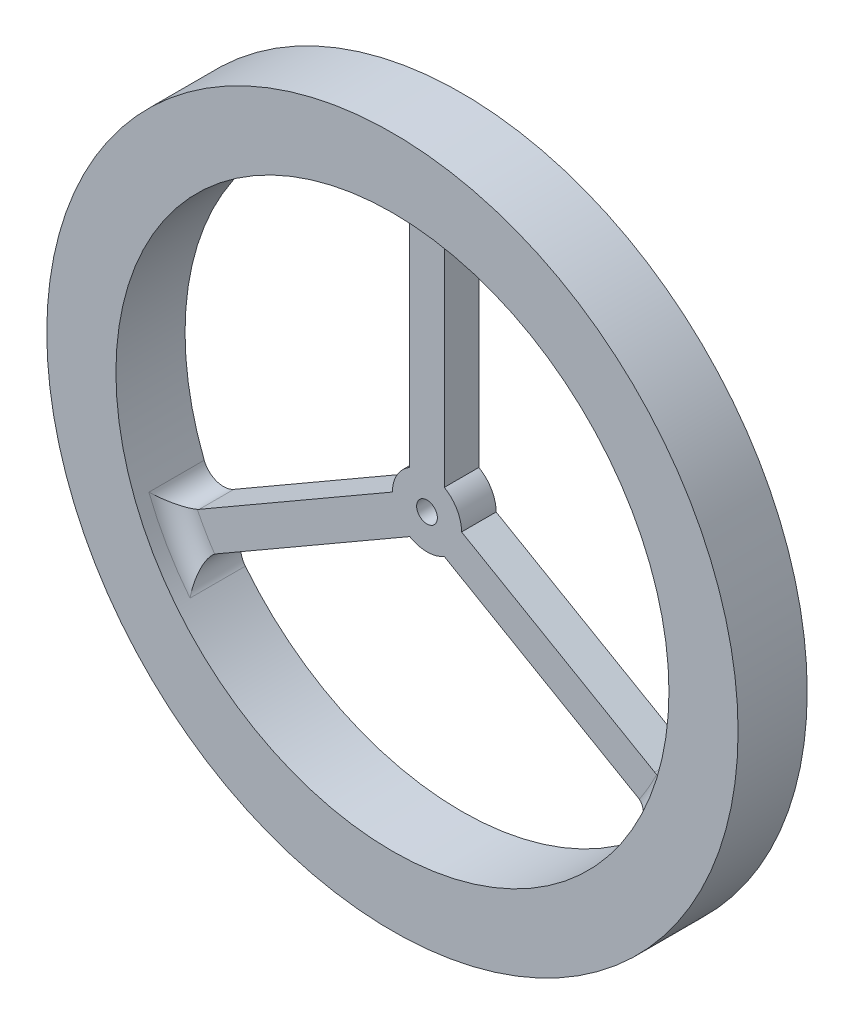
ISO-10303-21;
HEADER;
FILE_DESCRIPTION(('STEP AP214'),'2;1');
FILE_NAME('part.step','',(''),(''),'','','');
FILE_SCHEMA(('AUTOMOTIVE_DESIGN { 1 0 10303 214 1 1 1 1 }'));
ENDSEC;
DATA;
#1=APPLICATION_CONTEXT('core data for automotive mechanical design processes');
#2=APPLICATION_PROTOCOL_DEFINITION('international standard','automotive_design',2000,#1);
#3=PRODUCT_CONTEXT('',#1,'mechanical');
#4=PRODUCT('Part','Part','',(#3));
#5=PRODUCT_RELATED_PRODUCT_CATEGORY('part','',(#4));
#6=PRODUCT_DEFINITION_FORMATION('','',#4);
#7=PRODUCT_DEFINITION_CONTEXT('part definition',#1,'design');
#8=PRODUCT_DEFINITION('design','',#6,#7);
#9=PRODUCT_DEFINITION_SHAPE('','',#8);
#10=(LENGTH_UNIT() NAMED_UNIT(*) SI_UNIT(.MILLI.,.METRE.));
#11=(NAMED_UNIT(*) PLANE_ANGLE_UNIT() SI_UNIT($,.RADIAN.));
#12=(NAMED_UNIT(*) SI_UNIT($,.STERADIAN.) SOLID_ANGLE_UNIT());
#13=UNCERTAINTY_MEASURE_WITH_UNIT(LENGTH_MEASURE(1.E-05),#10,'distance_accuracy_value','');
#14=(GEOMETRIC_REPRESENTATION_CONTEXT(3) GLOBAL_UNCERTAINTY_ASSIGNED_CONTEXT((#13)) GLOBAL_UNIT_ASSIGNED_CONTEXT((#10,
#11,#12)) REPRESENTATION_CONTEXT('',''));
#15=CARTESIAN_POINT('',(0.,0.,0.));
#16=DIRECTION('',(0.,0.,1.));
#17=DIRECTION('',(1.,0.,0.));
#18=AXIS2_PLACEMENT_3D('',#15,#16,#17);
#19=CARTESIAN_POINT('',(2.5,40.,5.));
#20=DIRECTION('',(-1.,0.,0.));
#21=DIRECTION('',(0.,-1.,0.));
#22=AXIS2_PLACEMENT_3D('',#19,#20,#21);
#23=PLANE('',#22);
#24=DIRECTION('',(0.,0.,-1.));
#25=VECTOR('',#24,1.);
#26=CARTESIAN_POINT('',(2.5,4.33012701892219,5.));
#27=LINE('',#26,#25);
#28=CARTESIAN_POINT('',(2.5,4.33012701892219,0.));
#29=VERTEX_POINT('',#28);
#30=CARTESIAN_POINT('',(2.5,4.33012701892219,5.));
#31=VERTEX_POINT('',#30);
#32=EDGE_CURVE('E64',#29,#31,#27,.F.);
#33=ORIENTED_EDGE('',*,*,#32,.F.);
#34=DIRECTION('',(0.,1.,0.));
#35=VECTOR('',#34,1.);
#36=CARTESIAN_POINT('',(2.5,40.,0.));
#37=LINE('',#36,#35);
#38=CARTESIAN_POINT('',(2.5,36.5889327529514,0.));
#39=VERTEX_POINT('',#38);
#40=EDGE_CURVE('E268',#29,#39,#37,.T.);
#41=ORIENTED_EDGE('',*,*,#40,.T.);
#42=DIRECTION('',(0.,0.,-1.));
#43=VECTOR('',#42,1.);
#44=CARTESIAN_POINT('',(2.5,36.5889327529514,5.));
#45=LINE('',#44,#43);
#46=CARTESIAN_POINT('',(2.5,36.5889327529514,5.));
#47=VERTEX_POINT('',#46);
#48=EDGE_CURVE('E306',#39,#47,#45,.F.);
#49=ORIENTED_EDGE('',*,*,#48,.T.);
#50=DIRECTION('',(0.,1.,0.));
#51=VECTOR('',#50,1.);
#52=CARTESIAN_POINT('',(2.5,40.,5.));
#53=LINE('',#52,#51);
#54=EDGE_CURVE('E260',#31,#47,#53,.T.);
#55=ORIENTED_EDGE('',*,*,#54,.F.);
#56=EDGE_LOOP('',(#33,#41,#49,#55));
#57=FACE_BOUND('',#56,.T.);
#58=ADVANCED_FACE('F39',(#57),#23,.F.);
#59=CARTESIAN_POINT('',(-2.5,40.,5.));
#60=DIRECTION('',(1.,0.,0.));
#61=DIRECTION('',(0.,1.,0.));
#62=AXIS2_PLACEMENT_3D('',#59,#60,#61);
#63=PLANE('',#62);
#64=DIRECTION('',(0.,0.,-1.));
#65=VECTOR('',#64,1.);
#66=CARTESIAN_POINT('',(-2.5,4.33012701892219,5.));
#67=LINE('',#66,#65);
#68=CARTESIAN_POINT('',(-2.5,4.33012701892219,5.));
#69=VERTEX_POINT('',#68);
#70=CARTESIAN_POINT('',(-2.5,4.33012701892219,0.));
#71=VERTEX_POINT('',#70);
#72=EDGE_CURVE('E212',#69,#71,#67,.T.);
#73=ORIENTED_EDGE('',*,*,#72,.F.);
#74=DIRECTION('',(0.,-1.,0.));
#75=VECTOR('',#74,1.);
#76=CARTESIAN_POINT('',(-2.5,40.,5.));
#77=LINE('',#76,#75);
#78=CARTESIAN_POINT('',(-2.5,36.5889327529514,5.));
#79=VERTEX_POINT('',#78);
#80=EDGE_CURVE('E263',#79,#69,#77,.T.);
#81=ORIENTED_EDGE('',*,*,#80,.F.);
#82=DIRECTION('',(0.,0.,-1.));
#83=VECTOR('',#82,1.);
#84=CARTESIAN_POINT('',(-2.5,36.5889327529514,5.));
#85=LINE('',#84,#83);
#86=CARTESIAN_POINT('',(-2.5,36.5889327529514,0.));
#87=VERTEX_POINT('',#86);
#88=EDGE_CURVE('E303',#79,#87,#85,.T.);
#89=ORIENTED_EDGE('',*,*,#88,.T.);
#90=DIRECTION('',(0.,-1.,0.));
#91=VECTOR('',#90,1.);
#92=CARTESIAN_POINT('',(-2.5,40.,0.));
#93=LINE('',#92,#91);
#94=EDGE_CURVE('E56',#87,#71,#93,.T.);
#95=ORIENTED_EDGE('',*,*,#94,.T.);
#96=EDGE_LOOP('',(#73,#81,#89,#95));
#97=FACE_BOUND('',#96,.T.);
#98=ADVANCED_FACE('F531',(#97),#63,.F.);
#99=CARTESIAN_POINT('',(35.8910161513775,-17.8349364905391,5.));
#100=DIRECTION('',(-0.500000000000004,-0.866025403784436,0.));
#101=DIRECTION('',(0.866025403784436,-0.500000000000004,0.));
#102=AXIS2_PLACEMENT_3D('',#99,#100,#101);
#103=PLANE('',#102);
#104=DIRECTION('',(0.,0.,-1.));
#105=VECTOR('',#104,1.);
#106=CARTESIAN_POINT('',(5.,0.,5.));
#107=LINE('',#106,#105);
#108=CARTESIAN_POINT('',(4.99999999999999,0.,5.));
#109=VERTEX_POINT('',#108);
#110=CARTESIAN_POINT('',(4.99999999999999,0.,0.));
#111=VERTEX_POINT('',#110);
#112=EDGE_CURVE('E208',#109,#111,#107,.T.);
#113=ORIENTED_EDGE('',*,*,#112,.F.);
#114=DIRECTION('',(-0.866025403784437,0.500000000000004,0.));
#115=VECTOR('',#114,1.);
#116=CARTESIAN_POINT('',(35.8910161513775,-17.8349364905391,5.));
#117=LINE('',#116,#115);
#118=CARTESIAN_POINT('',(32.9369452614163,-16.1294028670148,5.));
#119=VERTEX_POINT('',#118);
#120=EDGE_CURVE('E250',#119,#109,#117,.T.);
#121=ORIENTED_EDGE('',*,*,#120,.F.);
#122=DIRECTION('',(0.,0.,-1.));
#123=VECTOR('',#122,1.);
#124=CARTESIAN_POINT('',(32.9369452614163,-16.1294028670148,5.));
#125=LINE('',#124,#123);
#126=CARTESIAN_POINT('',(32.9369452614163,-16.1294028670148,0.));
#127=VERTEX_POINT('',#126);
#128=EDGE_CURVE('E478',#119,#127,#125,.T.);
#129=ORIENTED_EDGE('',*,*,#128,.T.);
#130=DIRECTION('',(-0.866025403784437,0.500000000000004,0.));
#131=VECTOR('',#130,1.);
#132=CARTESIAN_POINT('',(35.8910161513775,-17.8349364905391,0.));
#133=LINE('',#132,#131);
#134=EDGE_CURVE('E251',#127,#111,#133,.T.);
#135=ORIENTED_EDGE('',*,*,#134,.T.);
#136=EDGE_LOOP('',(#113,#121,#129,#135));
#137=FACE_BOUND('',#136,.T.);
#138=ADVANCED_FACE('F536',(#137),#103,.F.);
#139=CARTESIAN_POINT('',(-35.8910161513777,-17.8349364905386,5.));
#140=DIRECTION('',(0.499999999999992,-0.866025403784443,0.));
#141=DIRECTION('',(0.866025403784443,0.499999999999992,0.));
#142=AXIS2_PLACEMENT_3D('',#139,#140,#141);
#143=PLANE('',#142);
#144=DIRECTION('',(0.,0.,-1.));
#145=VECTOR('',#144,1.);
#146=CARTESIAN_POINT('',(-5.,0.,5.));
#147=LINE('',#146,#145);
#148=CARTESIAN_POINT('',(-5.,0.,0.));
#149=VERTEX_POINT('',#148);
#150=CARTESIAN_POINT('',(-5.00000000000001,0.,5.));
#151=VERTEX_POINT('',#150);
#152=EDGE_CURVE('E201',#149,#151,#147,.F.);
#153=ORIENTED_EDGE('',*,*,#152,.F.);
#154=DIRECTION('',(-0.866025403784443,-0.499999999999992,0.));
#155=VECTOR('',#154,1.);
#156=CARTESIAN_POINT('',(-35.8910161513777,-17.8349364905386,0.));
#157=LINE('',#156,#155);
#158=CARTESIAN_POINT('',(-32.9369452614166,-16.1294028670143,0.));
#159=VERTEX_POINT('',#158);
#160=EDGE_CURVE('E184',#149,#159,#157,.T.);
#161=ORIENTED_EDGE('',*,*,#160,.T.);
#162=DIRECTION('',(0.,0.,-1.));
#163=VECTOR('',#162,1.);
#164=CARTESIAN_POINT('',(-32.9369452614166,-16.1294028670143,5.));
#165=LINE('',#164,#163);
#166=CARTESIAN_POINT('',(-32.9369452614166,-16.1294028670143,5.));
#167=VERTEX_POINT('',#166);
#168=EDGE_CURVE('E433',#159,#167,#165,.F.);
#169=ORIENTED_EDGE('',*,*,#168,.T.);
#170=DIRECTION('',(-0.866025403784443,-0.499999999999992,0.));
#171=VECTOR('',#170,1.);
#172=CARTESIAN_POINT('',(-35.8910161513777,-17.8349364905386,5.));
#173=LINE('',#172,#171);
#174=EDGE_CURVE('E203',#151,#167,#173,.T.);
#175=ORIENTED_EDGE('',*,*,#174,.F.);
#176=EDGE_LOOP('',(#153,#161,#169,#175));
#177=FACE_BOUND('',#176,.T.);
#178=ADVANCED_FACE('F202',(#177),#143,.F.);
#179=CARTESIAN_POINT('',(33.3910161513775,-22.1650635094613,5.));
#180=DIRECTION('',(0.500000000000004,0.866025403784436,0.));
#181=DIRECTION('',(-0.866025403784436,0.500000000000004,0.));
#182=AXIS2_PLACEMENT_3D('',#179,#180,#181);
#183=PLANE('',#182);
#184=DIRECTION('',(0.,0.,-1.));
#185=VECTOR('',#184,1.);
#186=CARTESIAN_POINT('',(2.49999999999998,-4.33012701892221,5.));
#187=LINE('',#186,#185);
#188=CARTESIAN_POINT('',(2.49999999999996,-4.3301270189222,0.));
#189=VERTEX_POINT('',#188);
#190=CARTESIAN_POINT('',(2.49999999999996,-4.3301270189222,5.));
#191=VERTEX_POINT('',#190);
#192=EDGE_CURVE('E209',#189,#191,#187,.F.);
#193=ORIENTED_EDGE('',*,*,#192,.F.);
#194=DIRECTION('',(0.866025403784437,-0.500000000000004,0.));
#195=VECTOR('',#194,1.);
#196=CARTESIAN_POINT('',(33.3910161513775,-22.1650635094613,0.));
#197=LINE('',#196,#195);
#198=CARTESIAN_POINT('',(30.4369452614163,-20.4595298859369,0.));
#199=VERTEX_POINT('',#198);
#200=EDGE_CURVE('E243',#189,#199,#197,.T.);
#201=ORIENTED_EDGE('',*,*,#200,.T.);
#202=DIRECTION('',(0.,0.,-1.));
#203=VECTOR('',#202,1.);
#204=CARTESIAN_POINT('',(30.4369452614163,-20.4595298859369,5.));
#205=LINE('',#204,#203);
#206=CARTESIAN_POINT('',(30.4369452614163,-20.4595298859369,5.));
#207=VERTEX_POINT('',#206);
#208=EDGE_CURVE('E474',#199,#207,#205,.F.);
#209=ORIENTED_EDGE('',*,*,#208,.T.);
#210=DIRECTION('',(0.866025403784437,-0.500000000000004,0.));
#211=VECTOR('',#210,1.);
#212=CARTESIAN_POINT('',(33.3910161513775,-22.1650635094613,5.));
#213=LINE('',#212,#211);
#214=EDGE_CURVE('E247',#191,#207,#213,.T.);
#215=ORIENTED_EDGE('',*,*,#214,.F.);
#216=EDGE_LOOP('',(#193,#201,#209,#215));
#217=FACE_BOUND('',#216,.T.);
#218=ADVANCED_FACE('F461',(#217),#183,.F.);
#219=CARTESIAN_POINT('',(-33.3910161513778,-22.1650635094608,5.));
#220=DIRECTION('',(-0.499999999999992,0.866025403784443,0.));
#221=DIRECTION('',(-0.866025403784443,-0.499999999999992,0.));
#222=AXIS2_PLACEMENT_3D('',#219,#220,#221);
#223=PLANE('',#222);
#224=DIRECTION('',(0.,0.,-1.));
#225=VECTOR('',#224,1.);
#226=CARTESIAN_POINT('',(-2.50000000000004,-4.33012701892217,5.));
#227=LINE('',#226,#225);
#228=CARTESIAN_POINT('',(-2.50000000000005,-4.33012701892217,5.));
#229=VERTEX_POINT('',#228);
#230=CARTESIAN_POINT('',(-2.50000000000005,-4.33012701892217,0.));
#231=VERTEX_POINT('',#230);
#232=EDGE_CURVE('E11',#229,#231,#227,.T.);
#233=ORIENTED_EDGE('',*,*,#232,.F.);
#234=DIRECTION('',(0.866025403784443,0.499999999999992,0.));
#235=VECTOR('',#234,1.);
#236=CARTESIAN_POINT('',(-33.3910161513778,-22.1650635094608,5.));
#237=LINE('',#236,#235);
#238=CARTESIAN_POINT('',(-30.4369452614166,-20.4595298859365,5.));
#239=VERTEX_POINT('',#238);
#240=EDGE_CURVE('E240',#239,#229,#237,.T.);
#241=ORIENTED_EDGE('',*,*,#240,.F.);
#242=DIRECTION('',(0.,0.,-1.));
#243=VECTOR('',#242,1.);
#244=CARTESIAN_POINT('',(-30.4369452614166,-20.4595298859365,5.));
#245=LINE('',#244,#243);
#246=CARTESIAN_POINT('',(-30.4369452614166,-20.4595298859365,0.));
#247=VERTEX_POINT('',#246);
#248=EDGE_CURVE('E430',#239,#247,#245,.T.);
#249=ORIENTED_EDGE('',*,*,#248,.T.);
#250=DIRECTION('',(0.866025403784443,0.499999999999992,0.));
#251=VECTOR('',#250,1.);
#252=CARTESIAN_POINT('',(-33.3910161513778,-22.1650635094608,0.));
#253=LINE('',#252,#251);
#254=EDGE_CURVE('E197',#247,#231,#253,.T.);
#255=ORIENTED_EDGE('',*,*,#254,.T.);
#256=EDGE_LOOP('',(#233,#241,#249,#255));
#257=FACE_BOUND('',#256,.T.);
#258=ADVANCED_FACE('F517',(#257),#223,.F.);
#259=CARTESIAN_POINT('',(0.,0.,10.));
#260=DIRECTION('',(0.,0.,-1.));
#261=DIRECTION('',(-1.,0.,0.));
#262=AXIS2_PLACEMENT_3D('',#259,#260,#261);
#263=CYLINDRICAL_SURFACE('',#262,40.);
#264=CARTESIAN_POINT('',(0.,0.,10.));
#265=DIRECTION('',(0.,0.,1.));
#266=DIRECTION('',(1.,0.,0.));
#267=AXIS2_PLACEMENT_3D('',#264,#265,#266);
#268=CIRCLE('',#267,40.);
#269=CARTESIAN_POINT('',(40.,0.,10.));
#270=VERTEX_POINT('',#269);
#271=EDGE_CURVE('E274',#270,#270,#268,.T.);
#272=ORIENTED_EDGE('',*,*,#271,.T.);
#273=EDGE_LOOP('',(#272));
#274=FACE_BOUND('',#273,.T.);
#275=CARTESIAN_POINT('',(0.,0.,0.));
#276=DIRECTION('',(0.,0.,1.));
#277=DIRECTION('',(1.,0.,0.));
#278=AXIS2_PLACEMENT_3D('',#275,#276,#277);
#279=CIRCLE('',#278,40.);
#280=CARTESIAN_POINT('',(-31.2831840663964,-24.9271417267998,0.));
#281=VERTEX_POINT('',#280);
#282=CARTESIAN_POINT('',(31.283184066396,-24.9271417268003,0.));
#283=VERTEX_POINT('',#282);
#284=EDGE_CURVE('E282',#281,#283,#279,.T.);
#285=ORIENTED_EDGE('',*,*,#284,.F.);
#286=DIRECTION('',(0.,0.,-1.));
#287=VECTOR('',#286,1.);
#288=CARTESIAN_POINT('',(-31.2831840663964,-24.9271417267998,10.));
#289=LINE('',#288,#287);
#290=CARTESIAN_POINT('',(-31.2831840663964,-24.9271417267998,8.));
#291=VERTEX_POINT('',#290);
#292=EDGE_CURVE('E425',#281,#291,#289,.F.);
#293=ORIENTED_EDGE('',*,*,#292,.T.);
#294=CARTESIAN_POINT('',(0.,0.,8.));
#295=DIRECTION('',(0.,0.,1.));
#296=DIRECTION('',(1.,0.,0.));
#297=AXIS2_PLACEMENT_3D('',#294,#295,#296);
#298=CIRCLE('',#297,40.);
#299=CARTESIAN_POINT('',(-37.2291300123422,-14.6284612493632,8.));
#300=VERTEX_POINT('',#299);
#301=EDGE_CURVE('E413',#291,#300,#298,.F.);
#302=ORIENTED_EDGE('',*,*,#301,.T.);
#303=DIRECTION('',(0.,0.,-1.));
#304=VECTOR('',#303,1.);
#305=CARTESIAN_POINT('',(-37.2291300123422,-14.6284612493632,10.));
#306=LINE('',#305,#304);
#307=CARTESIAN_POINT('',(-37.2291300123422,-14.6284612493632,0.));
#308=VERTEX_POINT('',#307);
#309=EDGE_CURVE('E419',#300,#308,#306,.T.);
#310=ORIENTED_EDGE('',*,*,#309,.T.);
#311=CARTESIAN_POINT('',(-5.94594594594595,39.5556029761637,0.));
#312=VERTEX_POINT('',#311);
#313=EDGE_CURVE('E279',#312,#308,#279,.T.);
#314=ORIENTED_EDGE('',*,*,#313,.F.);
#315=DIRECTION('',(0.,0.,-1.));
#316=VECTOR('',#315,1.);
#317=CARTESIAN_POINT('',(-5.94594594594595,39.5556029761637,10.));
#318=LINE('',#317,#316);
#319=CARTESIAN_POINT('',(-5.94594594594595,39.5556029761637,8.));
#320=VERTEX_POINT('',#319);
#321=EDGE_CURVE('E300',#312,#320,#318,.F.);
#322=ORIENTED_EDGE('',*,*,#321,.T.);
#323=CARTESIAN_POINT('',(0.,0.,8.));
#324=DIRECTION('',(0.,0.,1.));
#325=DIRECTION('',(1.,0.,0.));
#326=AXIS2_PLACEMENT_3D('',#323,#324,#325);
#327=CIRCLE('',#326,40.);
#328=CARTESIAN_POINT('',(5.94594594594594,39.5556029761637,8.));
#329=VERTEX_POINT('',#328);
#330=EDGE_CURVE('E297',#320,#329,#327,.F.);
#331=ORIENTED_EDGE('',*,*,#330,.T.);
#332=DIRECTION('',(0.,0.,-1.));
#333=VECTOR('',#332,1.);
#334=CARTESIAN_POINT('',(5.94594594594594,39.5556029761637,10.));
#335=LINE('',#334,#333);
#336=CARTESIAN_POINT('',(5.94594594594594,39.5556029761637,0.));
#337=VERTEX_POINT('',#336);
#338=EDGE_CURVE('E293',#329,#337,#335,.T.);
#339=ORIENTED_EDGE('',*,*,#338,.T.);
#340=CARTESIAN_POINT('',(37.229130012342,-14.6284612493637,0.));
#341=VERTEX_POINT('',#340);
#342=EDGE_CURVE('E267',#341,#337,#279,.T.);
#343=ORIENTED_EDGE('',*,*,#342,.F.);
#344=DIRECTION('',(0.,0.,-1.));
#345=VECTOR('',#344,1.);
#346=CARTESIAN_POINT('',(37.229130012342,-14.6284612493637,10.));
#347=LINE('',#346,#345);
#348=CARTESIAN_POINT('',(37.229130012342,-14.6284612493637,8.));
#349=VERTEX_POINT('',#348);
#350=EDGE_CURVE('E483',#341,#349,#347,.F.);
#351=ORIENTED_EDGE('',*,*,#350,.T.);
#352=CARTESIAN_POINT('',(0.,0.,8.));
#353=DIRECTION('',(0.,0.,1.));
#354=DIRECTION('',(1.,0.,0.));
#355=AXIS2_PLACEMENT_3D('',#352,#353,#354);
#356=CIRCLE('',#355,40.);
#357=CARTESIAN_POINT('',(31.283184066396,-24.9271417268003,8.));
#358=VERTEX_POINT('',#357);
#359=EDGE_CURVE('E503',#349,#358,#356,.F.);
#360=ORIENTED_EDGE('',*,*,#359,.T.);
#361=DIRECTION('',(0.,0.,-1.));
#362=VECTOR('',#361,1.);
#363=CARTESIAN_POINT('',(31.283184066396,-24.9271417268003,10.));
#364=LINE('',#363,#362);
#365=EDGE_CURVE('E505',#358,#283,#364,.T.);
#366=ORIENTED_EDGE('',*,*,#365,.T.);
#367=EDGE_LOOP('',(#285,#293,#302,#310,#314,#322,#331,#339,#343,#351,#360,#366));
#368=FACE_BOUND('',#367,.T.);
#369=ADVANCED_FACE('F495',(#274,#368),#263,.F.);
#370=CARTESIAN_POINT('',(0.,0.,10.));
#371=DIRECTION('',(0.,0.,1.));
#372=DIRECTION('',(1.,0.,0.));
#373=AXIS2_PLACEMENT_3D('',#370,#371,#372);
#374=PLANE('',#373);
#375=CARTESIAN_POINT('',(0.,0.,10.));
#376=DIRECTION('',(0.,0.,1.));
#377=DIRECTION('',(1.,0.,0.));
#378=AXIS2_PLACEMENT_3D('',#375,#376,#377);
#379=CIRCLE('',#378,50.);
#380=CARTESIAN_POINT('',(50.,0.,10.));
#381=VERTEX_POINT('',#380);
#382=EDGE_CURVE('E283',#381,#381,#379,.T.);
#383=ORIENTED_EDGE('',*,*,#382,.T.);
#384=EDGE_LOOP('',(#383));
#385=FACE_BOUND('',#384,.T.);
#386=ORIENTED_EDGE('',*,*,#271,.F.);
#387=EDGE_LOOP('',(#386));
#388=FACE_BOUND('',#387,.T.);
#389=ADVANCED_FACE('F524',(#385,#388),#374,.T.);
#390=CARTESIAN_POINT('',(0.,0.,0.));
#391=DIRECTION('',(0.,0.,1.));
#392=DIRECTION('',(1.,0.,0.));
#393=AXIS2_PLACEMENT_3D('',#390,#391,#392);
#394=PLANE('',#393);
#395=CARTESIAN_POINT('',(0.,0.,0.));
#396=DIRECTION('',(0.,0.,1.));
#397=DIRECTION('',(1.,0.,0.));
#398=AXIS2_PLACEMENT_3D('',#395,#396,#397);
#399=CIRCLE('',#398,1.5);
#400=CARTESIAN_POINT('',(1.5,0.,0.));
#401=VERTEX_POINT('',#400);
#402=EDGE_CURVE('E222',#401,#401,#399,.T.);
#403=ORIENTED_EDGE('',*,*,#402,.T.);
#404=EDGE_LOOP('',(#403));
#405=FACE_BOUND('',#404,.T.);
#406=ORIENTED_EDGE('',*,*,#40,.F.);
#407=CARTESIAN_POINT('',(0.,0.,0.));
#408=DIRECTION('',(0.,0.,1.));
#409=DIRECTION('',(1.,0.,0.));
#410=AXIS2_PLACEMENT_3D('',#407,#408,#409);
#411=CIRCLE('',#410,5.);
#412=EDGE_CURVE('E214',#111,#29,#411,.T.);
#413=ORIENTED_EDGE('',*,*,#412,.F.);
#414=ORIENTED_EDGE('',*,*,#134,.F.);
#415=CARTESIAN_POINT('',(34.4369452614163,-13.5313266556614,0.));
#416=DIRECTION('',(0.,0.,1.));
#417=DIRECTION('',(1.,0.,0.));
#418=AXIS2_PLACEMENT_3D('',#415,#416,#417);
#419=CIRCLE('',#418,3.);
#420=EDGE_CURVE('E472',#127,#341,#419,.T.);
#421=ORIENTED_EDGE('',*,*,#420,.T.);
#422=ORIENTED_EDGE('',*,*,#342,.T.);
#423=CARTESIAN_POINT('',(5.5,36.5889327529514,0.));
#424=DIRECTION('',(0.,0.,1.));
#425=DIRECTION('',(1.,0.,0.));
#426=AXIS2_PLACEMENT_3D('',#423,#424,#425);
#427=CIRCLE('',#426,3.);
#428=EDGE_CURVE('E316',#337,#39,#427,.T.);
#429=ORIENTED_EDGE('',*,*,#428,.T.);
#430=EDGE_LOOP('',(#406,#413,#414,#421,#422,#429));
#431=FACE_BOUND('',#430,.T.);
#432=ORIENTED_EDGE('',*,*,#200,.F.);
#433=EDGE_CURVE('E215',#231,#189,#411,.T.);
#434=ORIENTED_EDGE('',*,*,#433,.F.);
#435=ORIENTED_EDGE('',*,*,#254,.F.);
#436=CARTESIAN_POINT('',(-28.9369452614166,-23.0576060972898,0.));
#437=DIRECTION('',(0.,0.,1.));
#438=DIRECTION('',(1.,0.,0.));
#439=AXIS2_PLACEMENT_3D('',#436,#437,#438);
#440=CIRCLE('',#439,3.);
#441=EDGE_CURVE('E439',#247,#281,#440,.T.);
#442=ORIENTED_EDGE('',*,*,#441,.T.);
#443=ORIENTED_EDGE('',*,*,#284,.T.);
#444=CARTESIAN_POINT('',(28.9369452614163,-23.0576060972902,0.));
#445=DIRECTION('',(0.,0.,1.));
#446=DIRECTION('',(1.,0.,0.));
#447=AXIS2_PLACEMENT_3D('',#444,#445,#446);
#448=CIRCLE('',#447,3.);
#449=EDGE_CURVE('E466',#283,#199,#448,.T.);
#450=ORIENTED_EDGE('',*,*,#449,.T.);
#451=EDGE_LOOP('',(#432,#434,#435,#442,#443,#450));
#452=FACE_BOUND('',#451,.T.);
#453=ORIENTED_EDGE('',*,*,#160,.F.);
#454=EDGE_CURVE('E189',#71,#149,#411,.T.);
#455=ORIENTED_EDGE('',*,*,#454,.F.);
#456=ORIENTED_EDGE('',*,*,#94,.F.);
#457=CARTESIAN_POINT('',(-5.5,36.5889327529514,0.));
#458=DIRECTION('',(0.,0.,1.));
#459=DIRECTION('',(1.,0.,0.));
#460=AXIS2_PLACEMENT_3D('',#457,#458,#459);
#461=CIRCLE('',#460,3.);
#462=EDGE_CURVE('E313',#87,#312,#461,.T.);
#463=ORIENTED_EDGE('',*,*,#462,.T.);
#464=ORIENTED_EDGE('',*,*,#313,.T.);
#465=CARTESIAN_POINT('',(-34.4369452614165,-13.531326655661,0.));
#466=DIRECTION('',(0.,0.,1.));
#467=DIRECTION('',(1.,0.,0.));
#468=AXIS2_PLACEMENT_3D('',#465,#466,#467);
#469=CIRCLE('',#468,3.);
#470=EDGE_CURVE('E192',#308,#159,#469,.T.);
#471=ORIENTED_EDGE('',*,*,#470,.T.);
#472=EDGE_LOOP('',(#453,#455,#456,#463,#464,#471));
#473=FACE_BOUND('',#472,.T.);
#474=CARTESIAN_POINT('',(0.,0.,0.));
#475=DIRECTION('',(0.,0.,1.));
#476=DIRECTION('',(1.,0.,0.));
#477=AXIS2_PLACEMENT_3D('',#474,#475,#476);
#478=CIRCLE('',#477,50.);
#479=CARTESIAN_POINT('',(50.,0.,0.));
#480=VERTEX_POINT('',#479);
#481=EDGE_CURVE('E278',#480,#480,#478,.T.);
#482=ORIENTED_EDGE('',*,*,#481,.F.);
#483=EDGE_LOOP('',(#482));
#484=FACE_BOUND('',#483,.T.);
#485=ADVANCED_FACE('F186',(#405,#431,#452,#473,#484),#394,.F.);
#486=CARTESIAN_POINT('',(0.,0.,10.));
#487=DIRECTION('',(0.,0.,-1.));
#488=DIRECTION('',(-1.,0.,0.));
#489=AXIS2_PLACEMENT_3D('',#486,#487,#488);
#490=CYLINDRICAL_SURFACE('',#489,50.);
#491=ORIENTED_EDGE('',*,*,#382,.F.);
#492=EDGE_LOOP('',(#491));
#493=FACE_BOUND('',#492,.T.);
#494=ORIENTED_EDGE('',*,*,#481,.T.);
#495=EDGE_LOOP('',(#494));
#496=FACE_BOUND('',#495,.T.);
#497=ADVANCED_FACE('F544',(#493,#496),#490,.T.);
#498=CARTESIAN_POINT('',(0.,0.,5.));
#499=DIRECTION('',(0.,0.,1.));
#500=DIRECTION('',(1.,0.,0.));
#501=AXIS2_PLACEMENT_3D('',#498,#499,#500);
#502=PLANE('',#501);
#503=CARTESIAN_POINT('',(0.,0.,5.));
#504=DIRECTION('',(0.,0.,1.));
#505=DIRECTION('',(1.,0.,0.));
#506=AXIS2_PLACEMENT_3D('',#503,#504,#505);
#507=CIRCLE('',#506,1.5);
#508=CARTESIAN_POINT('',(1.5,0.,5.));
#509=VERTEX_POINT('',#508);
#510=EDGE_CURVE('E632',#509,#509,#507,.T.);
#511=ORIENTED_EDGE('',*,*,#510,.F.);
#512=EDGE_LOOP('',(#511));
#513=FACE_BOUND('',#512,.T.);
#514=CARTESIAN_POINT('',(0.,0.,5.));
#515=DIRECTION('',(0.,0.,1.));
#516=DIRECTION('',(1.,0.,0.));
#517=AXIS2_PLACEMENT_3D('',#514,#515,#516);
#518=CIRCLE('',#517,5.);
#519=EDGE_CURVE('E225',#109,#31,#518,.T.);
#520=ORIENTED_EDGE('',*,*,#519,.T.);
#521=ORIENTED_EDGE('',*,*,#54,.T.);
#522=CARTESIAN_POINT('',(5.5,36.5889327529514,5.));
#523=DIRECTION('',(0.,0.,1.));
#524=DIRECTION('',(1.,0.,0.));
#525=AXIS2_PLACEMENT_3D('',#522,#523,#524);
#526=CIRCLE('',#525,3.);
#527=CARTESIAN_POINT('',(2.51768980341416,36.9142416697646,5.));
#528=VERTEX_POINT('',#527);
#529=EDGE_CURVE('E320',#47,#528,#526,.F.);
#530=ORIENTED_EDGE('',*,*,#529,.T.);
#531=CARTESIAN_POINT('',(0.,0.,5.));
#532=DIRECTION('',(0.,0.,1.));
#533=DIRECTION('',(1.,0.,0.));
#534=AXIS2_PLACEMENT_3D('',#531,#532,#533);
#535=CIRCLE('',#534,37.);
#536=CARTESIAN_POINT('',(-2.51768980341416,36.9142416697646,5.));
#537=VERTEX_POINT('',#536);
#538=EDGE_CURVE('E287',#528,#537,#535,.T.);
#539=ORIENTED_EDGE('',*,*,#538,.T.);
#540=CARTESIAN_POINT('',(-5.5,36.5889327529514,5.));
#541=DIRECTION('',(0.,0.,1.));
#542=DIRECTION('',(1.,0.,0.));
#543=AXIS2_PLACEMENT_3D('',#540,#541,#542);
#544=CIRCLE('',#543,3.);
#545=EDGE_CURVE('E310',#537,#79,#544,.F.);
#546=ORIENTED_EDGE('',*,*,#545,.T.);
#547=ORIENTED_EDGE('',*,*,#80,.T.);
#548=EDGE_CURVE('E446',#69,#151,#518,.T.);
#549=ORIENTED_EDGE('',*,*,#548,.T.);
#550=ORIENTED_EDGE('',*,*,#174,.T.);
#551=CARTESIAN_POINT('',(-34.4369452614165,-13.531326655661,5.));
#552=DIRECTION('',(0.,0.,1.));
#553=DIRECTION('',(1.,0.,0.));
#554=AXIS2_PLACEMENT_3D('',#551,#552,#553);
#555=CIRCLE('',#554,3.);
#556=CARTESIAN_POINT('',(-33.2275159491615,-16.2767375062763,5.));
#557=VERTEX_POINT('',#556);
#558=EDGE_CURVE('E49',#167,#557,#555,.F.);
#559=ORIENTED_EDGE('',*,*,#558,.T.);
#560=CARTESIAN_POINT('',(0.,0.,5.));
#561=DIRECTION('',(0.,0.,1.));
#562=DIRECTION('',(1.,0.,0.));
#563=AXIS2_PLACEMENT_3D('',#560,#561,#562);
#564=CIRCLE('',#563,37.);
#565=CARTESIAN_POINT('',(-30.7098261457473,-20.6375041634877,5.));
#566=VERTEX_POINT('',#565);
#567=EDGE_CURVE('E383',#557,#566,#564,.T.);
#568=ORIENTED_EDGE('',*,*,#567,.T.);
#569=CARTESIAN_POINT('',(-28.9369452614166,-23.0576060972898,5.));
#570=DIRECTION('',(0.,0.,1.));
#571=DIRECTION('',(1.,0.,0.));
#572=AXIS2_PLACEMENT_3D('',#569,#570,#571);
#573=CIRCLE('',#572,3.);
#574=EDGE_CURVE('E436',#566,#239,#573,.F.);
#575=ORIENTED_EDGE('',*,*,#574,.T.);
#576=ORIENTED_EDGE('',*,*,#240,.T.);
#577=EDGE_CURVE('E220',#229,#191,#518,.T.);
#578=ORIENTED_EDGE('',*,*,#577,.T.);
#579=ORIENTED_EDGE('',*,*,#214,.T.);
#580=CARTESIAN_POINT('',(28.9369452614163,-23.0576060972902,5.));
#581=DIRECTION('',(0.,0.,1.));
#582=DIRECTION('',(1.,0.,0.));
#583=AXIS2_PLACEMENT_3D('',#580,#581,#582);
#584=CIRCLE('',#583,3.);
#585=CARTESIAN_POINT('',(30.7098261457471,-20.6375041634881,5.));
#586=VERTEX_POINT('',#585);
#587=EDGE_CURVE('E374',#207,#586,#584,.F.);
#588=ORIENTED_EDGE('',*,*,#587,.T.);
#589=CARTESIAN_POINT('',(0.,0.,5.));
#590=DIRECTION('',(0.,0.,1.));
#591=DIRECTION('',(1.,0.,0.));
#592=AXIS2_PLACEMENT_3D('',#589,#590,#591);
#593=CIRCLE('',#592,37.);
#594=CARTESIAN_POINT('',(33.2275159491612,-16.2767375062767,5.));
#595=VERTEX_POINT('',#594);
#596=EDGE_CURVE('E324',#586,#595,#593,.T.);
#597=ORIENTED_EDGE('',*,*,#596,.T.);
#598=CARTESIAN_POINT('',(34.4369452614163,-13.5313266556614,5.));
#599=DIRECTION('',(0.,0.,1.));
#600=DIRECTION('',(1.,0.,0.));
#601=AXIS2_PLACEMENT_3D('',#598,#599,#600);
#602=CIRCLE('',#601,3.);
#603=EDGE_CURVE('E477',#595,#119,#602,.F.);
#604=ORIENTED_EDGE('',*,*,#603,.T.);
#605=ORIENTED_EDGE('',*,*,#120,.T.);
#606=EDGE_LOOP('',(#520,#521,#530,#539,#546,#547,#549,#550,#559,#568,#575,#576,#578,#579,#588,
#597,#604,#605));
#607=FACE_BOUND('',#606,.T.);
#608=ADVANCED_FACE('F353',(#513,#607),#502,.T.);
#609=CARTESIAN_POINT('',(5.5,36.5889327529514,10.));
#610=DIRECTION('',(0.,0.,-1.));
#611=DIRECTION('',(-1.,0.,0.));
#612=AXIS2_PLACEMENT_3D('',#609,#610,#611);
#613=CYLINDRICAL_SURFACE('',#612,3.);
#614=ORIENTED_EDGE('',*,*,#428,.F.);
#615=ORIENTED_EDGE('',*,*,#338,.F.);
#616=CARTESIAN_POINT('',(2.51768980341416,36.9142416697646,5.));
#617=CARTESIAN_POINT('',(2.52503553254496,36.981740984174,4.99998360218306));
#618=CARTESIAN_POINT('',(2.53470414059292,37.0489710215071,5.00230074518412));
#619=CARTESIAN_POINT('',(2.55848673753895,37.182272881547,5.01143554693343));
#620=CARTESIAN_POINT('',(2.57259692085118,37.2483456448467,5.01824935835136));
#621=CARTESIAN_POINT('',(2.6049368512034,37.3782735492396,5.03613478405754));
#622=CARTESIAN_POINT('',(2.62313039795476,37.4421428075701,5.04716954966179));
#623=CARTESIAN_POINT('',(2.66341802296233,37.5677901249628,5.07323892881705));
#624=CARTESIAN_POINT('',(2.68551275048423,37.6295678338899,5.08827420837704));
#625=CARTESIAN_POINT('',(2.75703078413046,37.8107761542127,5.13884029813938));
#626=CARTESIAN_POINT('',(2.81182526662287,37.9266203759275,5.1799091756483));
#627=CARTESIAN_POINT('',(2.93307680661222,38.1467496032176,5.27428359678954));
#628=CARTESIAN_POINT('',(2.99956100060642,38.2510067708722,5.32761770362752));
#629=CARTESIAN_POINT('',(3.17043697365603,38.4868402432541,5.46765780534647));
#630=CARTESIAN_POINT('',(3.27927493045814,38.6123752726193,5.55913047159761));
#631=CARTESIAN_POINT('',(3.50919620215588,38.8390162892025,5.75577709366105));
#632=CARTESIAN_POINT('',(3.63030039878693,38.940079590266,5.86097450488161));
#633=CARTESIAN_POINT('',(3.92465408874716,39.1504828966542,6.11977889411458));
#634=CARTESIAN_POINT('',(4.10124809642198,39.2502040267272,6.27738752612877));
#635=CARTESIAN_POINT('',(4.46194869170853,39.4105430462915,6.6034038507209));
#636=CARTESIAN_POINT('',(4.64606499070857,39.4711085729875,6.77182567446988));
#637=CARTESIAN_POINT('',(5.01613745596267,39.5557139397808,7.11432780115265));
#638=CARTESIAN_POINT('',(5.20208657337412,39.5798612378629,7.28838990278492));
#639=CARTESIAN_POINT('',(5.57219687158918,39.5937571286387,7.63907365892843));
#640=CARTESIAN_POINT('',(5.75636111615706,39.5835823594557,7.81568873526719));
#641=CARTESIAN_POINT('',(5.94053339428812,39.5564127951735,7.99473643225851));
#642=CARTESIAN_POINT('',(5.94323997382385,39.5560097315493,7.99736824106946));
#643=CARTESIAN_POINT('',(5.94594594594594,39.5556029761637,8.));
#644=B_SPLINE_CURVE_WITH_KNOTS('',3,(#616,#617,#618,#619,#620,#621,#622,#623,#624,#625,#626,
#627,#628,#629,#630,#631,#632,#633,#634,#635,#636,#637,#638,#639,#640,#641,#642,#643),
.UNSPECIFIED.,.F.,.F.,(4,2,2,2,2,2,2,2,2,2,2,2,2,4),(0.,0.203589097399368,0.407004230279082,
0.608682658063674,0.810394682476027,1.21215794666407,1.61486648350571,2.18070541323677,
2.7475243411863,3.51395481582085,4.2814081294676,5.04659248459974,5.81006938314838,
5.8214592846356),.UNSPECIFIED.);
#645=EDGE_CURVE('E271',#528,#329,#644,.T.);
#646=ORIENTED_EDGE('',*,*,#645,.F.);
#647=ORIENTED_EDGE('',*,*,#529,.F.);
#648=ORIENTED_EDGE('',*,*,#48,.F.);
#649=EDGE_LOOP('',(#614,#615,#646,#647,#648));
#650=FACE_BOUND('',#649,.T.);
#651=ADVANCED_FACE('F348',(#650),#613,.F.);
#652=CARTESIAN_POINT('',(-5.5,36.5889327529514,10.));
#653=DIRECTION('',(0.,0.,-1.));
#654=DIRECTION('',(-1.,0.,0.));
#655=AXIS2_PLACEMENT_3D('',#652,#653,#654);
#656=CYLINDRICAL_SURFACE('',#655,3.);
#657=ORIENTED_EDGE('',*,*,#88,.F.);
#658=ORIENTED_EDGE('',*,*,#545,.F.);
#659=CARTESIAN_POINT('',(-2.51768980341416,36.9142416697646,5.));
#660=CARTESIAN_POINT('',(-2.52503553254496,36.981740984174,4.99998360218306));
#661=CARTESIAN_POINT('',(-2.53470414059292,37.0489710215071,5.00230074518412));
#662=CARTESIAN_POINT('',(-2.55848673753896,37.182272881547,5.01143554693342));
#663=CARTESIAN_POINT('',(-2.57259692085118,37.2483456448467,5.01824935835136));
#664=CARTESIAN_POINT('',(-2.6049368512034,37.3782735492395,5.03613478405754));
#665=CARTESIAN_POINT('',(-2.62313039795476,37.4421428075701,5.04716954966179));
#666=CARTESIAN_POINT('',(-2.66341802296234,37.5677901249628,5.07323892881705));
#667=CARTESIAN_POINT('',(-2.68551275048424,37.6295678338899,5.08827420837704));
#668=CARTESIAN_POINT('',(-2.75703078413047,37.8107761542127,5.13884029813938));
#669=CARTESIAN_POINT('',(-2.81182526662287,37.9266203759275,5.1799091756483));
#670=CARTESIAN_POINT('',(-2.93307680661223,38.1467496032176,5.27428359678955));
#671=CARTESIAN_POINT('',(-2.99956100060643,38.2510067708722,5.32761770362752));
#672=CARTESIAN_POINT('',(-3.17043697365603,38.4868402432541,5.46765780534647));
#673=CARTESIAN_POINT('',(-3.27927493045813,38.6123752726193,5.55913047159762));
#674=CARTESIAN_POINT('',(-3.50919620215589,38.8390162892025,5.75577709366103));
#675=CARTESIAN_POINT('',(-3.63030039878698,38.940079590266,5.86097450488156));
#676=CARTESIAN_POINT('',(-3.9246540887471,39.1504828966543,6.11977889411465));
#677=CARTESIAN_POINT('',(-4.10124809642171,39.2502040267272,6.27738752612908));
#678=CARTESIAN_POINT('',(-4.46194869170883,39.4105430462915,6.60340385072062));
#679=CARTESIAN_POINT('',(-4.64606499070964,39.4711085729873,6.77182567446878));
#680=CARTESIAN_POINT('',(-5.01613745596162,39.5557139397809,7.11432780115376));
#681=CARTESIAN_POINT('',(-5.2020865733702,39.5798612378634,7.28838990278905));
#682=CARTESIAN_POINT('',(-5.57219687159312,39.5937571286381,7.6390736589243));
#683=CARTESIAN_POINT('',(-5.75636111617171,39.5835823594537,7.81568873525182));
#684=CARTESIAN_POINT('',(-5.94053339428857,39.5564127951734,7.99473643225806));
#685=CARTESIAN_POINT('',(-5.94323997382408,39.5560097315493,7.99736824106923));
#686=CARTESIAN_POINT('',(-5.94594594594595,39.5556029761637,8.));
#687=B_SPLINE_CURVE_WITH_KNOTS('',3,(#659,#660,#661,#662,#663,#664,#665,#666,#667,#668,#669,
#670,#671,#672,#673,#674,#675,#676,#677,#678,#679,#680,#681,#682,#683,#684,#685,#686),
.UNSPECIFIED.,.F.,.F.,(4,2,2,2,2,2,2,2,2,2,2,2,2,4),(0.,0.203589097399361,0.407004230279067,
0.608682658063667,0.810394682476027,1.21215794666408,1.61486648350571,2.18070541323676,
2.7475243411863,3.51395481582087,4.2814081294676,5.04659248459974,5.81006938314839,
5.8214592846356),.UNSPECIFIED.);
#688=EDGE_CURVE('E255',#320,#537,#687,.F.);
#689=ORIENTED_EDGE('',*,*,#688,.F.);
#690=ORIENTED_EDGE('',*,*,#321,.F.);
#691=ORIENTED_EDGE('',*,*,#462,.F.);
#692=EDGE_LOOP('',(#657,#658,#689,#690,#691));
#693=FACE_BOUND('',#692,.T.);
#694=ADVANCED_FACE('F340',(#693),#656,.F.);
#695=CARTESIAN_POINT('',(0.,0.,8.));
#696=DIRECTION('',(0.,0.,1.));
#697=DIRECTION('',(1.,0.,0.));
#698=AXIS2_PLACEMENT_3D('',#695,#696,#697);
#699=TOROIDAL_SURFACE('',#698,37.,3.);
#700=ORIENTED_EDGE('',*,*,#645,.T.);
#701=ORIENTED_EDGE('',*,*,#330,.F.);
#702=ORIENTED_EDGE('',*,*,#688,.T.);
#703=ORIENTED_EDGE('',*,*,#538,.F.);
#704=EDGE_LOOP('',(#700,#701,#702,#703));
#705=FACE_BOUND('',#704,.T.);
#706=ADVANCED_FACE('F343',(#705),#699,.F.);
#707=CARTESIAN_POINT('',(28.9369452614163,-23.0576060972902,10.));
#708=DIRECTION('',(0.,0.,-1.));
#709=DIRECTION('',(-1.,0.,0.));
#710=AXIS2_PLACEMENT_3D('',#707,#708,#709);
#711=CYLINDRICAL_SURFACE('',#710,3.);
#712=ORIENTED_EDGE('',*,*,#449,.F.);
#713=ORIENTED_EDGE('',*,*,#365,.F.);
#714=CARTESIAN_POINT('',(30.7098261457471,-20.6375041634881,5.));
#715=CARTESIAN_POINT('',(30.7646094021982,-20.6776154087294,4.99998360218306));
#716=CARTESIAN_POINT('',(30.8179980184021,-20.7196036875848,5.00230074518412));
#717=CARTESIAN_POINT('',(30.9215495170954,-20.806850950728,5.01143554693343));
#718=CARTESIAN_POINT('',(30.971715116955,-20.8521071095782,5.01824935835136));
#719=CARTESIAN_POINT('',(31.0680660176436,-20.9450782630163,5.03613478405754));
#720=CARTESIAN_POINT('',(31.1142816445031,-20.9927689658532,5.04716954966179));
#721=CARTESIAN_POINT('',(31.2029516007787,-21.0904827312643,5.07323892881705));
#722=CARTESIAN_POINT('',(31.2454053023362,-21.1405061810514,5.08827420837705));
#723=CARTESIAN_POINT('',(31.3665772942898,-21.2930467751792,5.13884029813938));
#724=CARTESIAN_POINT('',(31.4395040919302,-21.3984222998622,5.17990917564831));
#725=CARTESIAN_POINT('',(31.5695158248842,-21.6134938273861,5.27428359678955));
#726=CARTESIAN_POINT('',(31.6265630836026,-21.7231994121625,5.32761770362753));
#727=CARTESIAN_POINT('',(31.7453628752232,-21.9890990819108,5.46765780534647));
#728=CARTESIAN_POINT('',(31.7996604213172,-22.14612303208,5.55913047159762));
#729=CARTESIAN_POINT('',(31.8809766633689,-22.4585612025323,5.75577709366105));
#730=CARTESIAN_POINT('',(31.9079479511648,-22.6139721638515,5.86097450488161));
#731=CARTESIAN_POINT('',(31.9429857145571,-22.9740915902488,6.1197788941146));
#732=CARTESIAN_POINT('',(31.9410497426569,-23.1768870520877,6.27738752612881));
#733=CARTESIAN_POINT('',(31.8995571091742,-23.5694324405483,6.6034038507209));
#734=CARTESIAN_POINT('',(31.8599502443864,-23.7591645960811,6.77182567446981));
#735=CARTESIAN_POINT('',(31.748184408699,-24.1219594356288,7.11432780115278));
#736=CARTESIAN_POINT('',(31.6761220235653,-24.2950697441592,7.28838990278531));
#737=CARTESIAN_POINT('',(31.5031010688774,-24.6225426100042,7.63907365892804));
#738=CARTESIAN_POINT('',(31.4022073380028,-24.7769461396781,7.81568873526576));
#739=CARTESIAN_POINT('',(31.2865916660599,-24.9228592290702,7.99473643225847));
#740=CARTESIAN_POINT('',(31.2848893129541,-24.9250016638934,7.99736824106944));
#741=CARTESIAN_POINT('',(31.283184066396,-24.9271417268003,8.));
#742=B_SPLINE_CURVE_WITH_KNOTS('',3,(#714,#715,#716,#717,#718,#719,#720,#721,#722,#723,#724,
#725,#726,#727,#728,#729,#730,#731,#732,#733,#734,#735,#736,#737,#738,#739,#740,#741),
.UNSPECIFIED.,.F.,.F.,(4,2,2,2,2,2,2,2,2,2,2,2,2,4),(0.,0.203589097399369,0.407004230279081,
0.608682658063676,0.810394682476031,1.21215794666407,1.61486648350572,2.18070541323679,
2.74752434118631,3.51395481582088,4.28140812946763,5.04659248459976,5.81006938314838,
5.82145928463559),.UNSPECIFIED.);
#743=EDGE_CURVE('E198',#586,#358,#742,.T.);
#744=ORIENTED_EDGE('',*,*,#743,.F.);
#745=ORIENTED_EDGE('',*,*,#587,.F.);
#746=ORIENTED_EDGE('',*,*,#208,.F.);
#747=EDGE_LOOP('',(#712,#713,#744,#745,#746));
#748=FACE_BOUND('',#747,.T.);
#749=ADVANCED_FACE('F346',(#748),#711,.F.);
#750=CARTESIAN_POINT('',(34.4369452614163,-13.5313266556614,10.));
#751=DIRECTION('',(0.,0.,-1.));
#752=DIRECTION('',(-1.,0.,0.));
#753=AXIS2_PLACEMENT_3D('',#750,#751,#752);
#754=CYLINDRICAL_SURFACE('',#753,3.);
#755=ORIENTED_EDGE('',*,*,#128,.F.);
#756=ORIENTED_EDGE('',*,*,#603,.F.);
#757=CARTESIAN_POINT('',(33.2275159491612,-16.2767375062767,5.));
#758=CARTESIAN_POINT('',(33.2896449347432,-16.3041255754448,4.99998360218306));
#759=CARTESIAN_POINT('',(33.3527021589951,-16.3293673339227,5.00230074518412));
#760=CARTESIAN_POINT('',(33.4800362546344,-16.3754219308194,5.01143554693343));
#761=CARTESIAN_POINT('',(33.5443120378062,-16.3962385352687,5.01824935835136));
#762=CARTESIAN_POINT('',(33.673002868847,-16.4331952862235,5.03613478405754));
#763=CARTESIAN_POINT('',(33.7374120424578,-16.4493738417172,5.04716954966179));
#764=CARTESIAN_POINT('',(33.8663696237411,-16.4773073936989,5.07323892881705));
#765=CARTESIAN_POINT('',(33.9309180528204,-16.4890616528387,5.08827420837704));
#766=CARTESIAN_POINT('',(34.1236080784203,-16.5177293790338,5.13884029813938));
#767=CARTESIAN_POINT('',(34.2513293585531,-16.5281980760655,5.17990917564831));
#768=CARTESIAN_POINT('',(34.5025926314964,-16.5332557758318,5.27428359678955));
#769=CARTESIAN_POINT('',(34.6261240842091,-16.52780735871,5.32761770362753));
#770=CARTESIAN_POINT('',(34.9157998488792,-16.4977411613436,5.46765780534647));
#771=CARTESIAN_POINT('',(35.0789353517754,-16.4662522405396,5.55913047159762));
#772=CARTESIAN_POINT('',(35.3901728655248,-16.3804550866705,5.75577709366105));
#773=CARTESIAN_POINT('',(35.5382483499517,-16.3261074264149,5.8609745048816));
#774=CARTESIAN_POINT('',(35.8676398033043,-16.1763913064058,6.11977889411462));
#775=CARTESIAN_POINT('',(36.0422978390789,-16.0733169746398,6.27738752612891));
#776=CARTESIAN_POINT('',(36.3615058008829,-15.8411106057435,6.60340385072082));
#777=CARTESIAN_POINT('',(36.5060152350953,-15.7119439769063,6.77182567446948));
#778=CARTESIAN_POINT('',(36.7643218646615,-15.4337545041526,7.11432780115312));
#779=CARTESIAN_POINT('',(36.8782085969387,-15.2847914937051,7.28838990278658));
#780=CARTESIAN_POINT('',(37.0752979404674,-14.9712145186336,7.63907365892681));
#781=CARTESIAN_POINT('',(37.1585684541628,-14.8066362197736,7.81568873526113));
#782=CARTESIAN_POINT('',(37.2271250603481,-14.6335535661034,7.99473643225833));
#783=CARTESIAN_POINT('',(37.2281292867781,-14.6310080676561,7.99736824106937));
#784=CARTESIAN_POINT('',(37.229130012342,-14.6284612493637,8.));
#785=B_SPLINE_CURVE_WITH_KNOTS('',3,(#757,#758,#759,#760,#761,#762,#763,#764,#765,#766,#767,
#768,#769,#770,#771,#772,#773,#774,#775,#776,#777,#778,#779,#780,#781,#782,#783,#784),
.UNSPECIFIED.,.F.,.F.,(4,2,2,2,2,2,2,2,2,2,2,2,2,4),(0.,0.203589097399367,0.407004230279082,
0.608682658063674,0.810394682476031,1.21215794666408,1.61486648350572,2.18070541323677,
2.74752434118631,3.51395481582089,4.28140812946763,5.04659248459974,5.81006938314838,
5.82145928463559),.UNSPECIFIED.);
#786=EDGE_CURVE('E364',#349,#595,#785,.F.);
#787=ORIENTED_EDGE('',*,*,#786,.F.);
#788=ORIENTED_EDGE('',*,*,#350,.F.);
#789=ORIENTED_EDGE('',*,*,#420,.F.);
#790=EDGE_LOOP('',(#755,#756,#787,#788,#789));
#791=FACE_BOUND('',#790,.T.);
#792=ADVANCED_FACE('F355',(#791),#754,.F.);
#793=CARTESIAN_POINT('',(0.,0.,8.));
#794=DIRECTION('',(0.,0.,1.));
#795=DIRECTION('',(1.,0.,0.));
#796=AXIS2_PLACEMENT_3D('',#793,#794,#795);
#797=TOROIDAL_SURFACE('',#796,37.,3.);
#798=ORIENTED_EDGE('',*,*,#743,.T.);
#799=ORIENTED_EDGE('',*,*,#359,.F.);
#800=ORIENTED_EDGE('',*,*,#786,.T.);
#801=ORIENTED_EDGE('',*,*,#596,.F.);
#802=EDGE_LOOP('',(#798,#799,#800,#801));
#803=FACE_BOUND('',#802,.T.);
#804=ADVANCED_FACE('F359',(#803),#797,.F.);
#805=CARTESIAN_POINT('',(-34.4369452614165,-13.531326655661,10.));
#806=DIRECTION('',(0.,0.,-1.));
#807=DIRECTION('',(-1.,0.,0.));
#808=AXIS2_PLACEMENT_3D('',#805,#806,#807);
#809=CYLINDRICAL_SURFACE('',#808,3.);
#810=ORIENTED_EDGE('',*,*,#470,.F.);
#811=ORIENTED_EDGE('',*,*,#309,.F.);
#812=CARTESIAN_POINT('',(-33.2275159491615,-16.2767375062763,5.));
#813=CARTESIAN_POINT('',(-33.2896449347434,-16.3041255754444,4.99998360218306));
#814=CARTESIAN_POINT('',(-33.3527021589953,-16.3293673339222,5.00230074518412));
#815=CARTESIAN_POINT('',(-33.4800362546346,-16.3754219308189,5.01143554693343));
#816=CARTESIAN_POINT('',(-33.5443120378064,-16.3962385352683,5.01824935835136));
#817=CARTESIAN_POINT('',(-33.6730028688472,-16.4331952862231,5.03613478405754));
#818=CARTESIAN_POINT('',(-33.7374120424581,-16.4493738417167,5.04716954966179));
#819=CARTESIAN_POINT('',(-33.8663696237413,-16.4773073936984,5.07323892881705));
#820=CARTESIAN_POINT('',(-33.9309180528207,-16.4890616528383,5.08827420837705));
#821=CARTESIAN_POINT('',(-34.1236080784205,-16.5177293790333,5.13884029813938));
#822=CARTESIAN_POINT('',(-34.2513293585533,-16.5281980760651,5.17990917564831));
#823=CARTESIAN_POINT('',(-34.5025926314967,-16.5332557758314,5.27428359678955));
#824=CARTESIAN_POINT('',(-34.6261240842093,-16.5278073587095,5.32761770362753));
#825=CARTESIAN_POINT('',(-34.9157998488795,-16.4977411613431,5.46765780534647));
#826=CARTESIAN_POINT('',(-35.0789353517756,-16.4662522405391,5.55913047159761));
#827=CARTESIAN_POINT('',(-35.3901728655251,-16.38045508667,5.75577709366106));
#828=CARTESIAN_POINT('',(-35.5382483499519,-16.3261074264145,5.86097450488165));
#829=CARTESIAN_POINT('',(-35.8676398033045,-16.1763913064052,6.11977889411454));
#830=CARTESIAN_POINT('',(-36.0422978390792,-16.0733169746391,6.27738752612859));
#831=CARTESIAN_POINT('',(-36.361505800883,-15.8411106057432,6.60340385072108));
#832=CARTESIAN_POINT('',(-36.5060152350951,-15.7119439769068,6.77182567447055));
#833=CARTESIAN_POINT('',(-36.7643218646621,-15.4337545041511,7.11432780115201));
#834=CARTESIAN_POINT('',(-36.8782085969403,-15.284791493701,7.28838990278249));
#835=CARTESIAN_POINT('',(-37.0752979404662,-14.9712145186368,7.63907365893088));
#836=CARTESIAN_POINT('',(-37.1585684541576,-14.8066362197867,7.8156887352763));
#837=CARTESIAN_POINT('',(-37.2271250603482,-14.6335535661033,7.99473643225878));
#838=CARTESIAN_POINT('',(-37.2281292867782,-14.6310080676558,7.9973682410696));
#839=CARTESIAN_POINT('',(-37.2291300123422,-14.6284612493632,8.));
#840=B_SPLINE_CURVE_WITH_KNOTS('',3,(#812,#813,#814,#815,#816,#817,#818,#819,#820,#821,#822,
#823,#824,#825,#826,#827,#828,#829,#830,#831,#832,#833,#834,#835,#836,#837,#838,#839),
.UNSPECIFIED.,.F.,.F.,(4,2,2,2,2,2,2,2,2,2,2,2,2,4),(0.,0.203589097399365,0.407004230279079,
0.608682658063678,0.810394682476028,1.21215794666407,1.61486648350572,2.18070541323678,
2.7475243411863,3.51395481582084,4.28140812946761,5.04659248459974,5.81006938314838,
5.82145928463559),.UNSPECIFIED.);
#841=EDGE_CURVE('E373',#557,#300,#840,.T.);
#842=ORIENTED_EDGE('',*,*,#841,.F.);
#843=ORIENTED_EDGE('',*,*,#558,.F.);
#844=ORIENTED_EDGE('',*,*,#168,.F.);
#845=EDGE_LOOP('',(#810,#811,#842,#843,#844));
#846=FACE_BOUND('',#845,.T.);
#847=ADVANCED_FACE('F41',(#846),#809,.F.);
#848=CARTESIAN_POINT('',(-28.9369452614166,-23.0576060972898,10.));
#849=DIRECTION('',(0.,0.,-1.));
#850=DIRECTION('',(-1.,0.,0.));
#851=AXIS2_PLACEMENT_3D('',#848,#849,#850);
#852=CYLINDRICAL_SURFACE('',#851,3.);
#853=ORIENTED_EDGE('',*,*,#248,.F.);
#854=ORIENTED_EDGE('',*,*,#574,.F.);
#855=CARTESIAN_POINT('',(-30.7098261457473,-20.6375041634877,5.));
#856=CARTESIAN_POINT('',(-30.7646094021985,-20.677615408729,4.99998360218306));
#857=CARTESIAN_POINT('',(-30.8179980184024,-20.7196036875844,5.00230074518412));
#858=CARTESIAN_POINT('',(-30.9215495170957,-20.8068509507275,5.01143554693343));
#859=CARTESIAN_POINT('',(-30.9717151169553,-20.8521071095778,5.01824935835136));
#860=CARTESIAN_POINT('',(-31.0680660176439,-20.9450782630159,5.03613478405754));
#861=CARTESIAN_POINT('',(-31.1142816445034,-20.9927689658528,5.04716954966179));
#862=CARTESIAN_POINT('',(-31.202951600779,-21.0904827312638,5.07323892881705));
#863=CARTESIAN_POINT('',(-31.2454053023365,-21.140506181051,5.08827420837704));
#864=CARTESIAN_POINT('',(-31.3665772942901,-21.2930467751788,5.13884029813938));
#865=CARTESIAN_POINT('',(-31.4395040919305,-21.3984222998618,5.17990917564831));
#866=CARTESIAN_POINT('',(-31.5695158248845,-21.6134938273856,5.27428359678955));
#867=CARTESIAN_POINT('',(-31.6265630836029,-21.723199412162,5.32761770362753));
#868=CARTESIAN_POINT('',(-31.7453628752235,-21.9890990819103,5.46765780534647));
#869=CARTESIAN_POINT('',(-31.7996604213175,-22.1461230320795,5.55913047159761));
#870=CARTESIAN_POINT('',(-31.8809766633692,-22.4585612025318,5.75577709366106));
#871=CARTESIAN_POINT('',(-31.9079479511651,-22.613972163851,5.86097450488164));
#872=CARTESIAN_POINT('',(-31.9429857145574,-22.9740915902484,6.11977889411456));
#873=CARTESIAN_POINT('',(-31.9410497426572,-23.1768870520874,6.27738752612865));
#874=CARTESIAN_POINT('',(-31.8995571091746,-23.5694324405477,6.60340385072104));
#875=CARTESIAN_POINT('',(-31.8599502443871,-23.7591645960802,6.77182567447037));
#876=CARTESIAN_POINT('',(-31.748184408699,-24.1219594356288,7.11432780115218));
#877=CARTESIAN_POINT('',(-31.6761220235644,-24.2950697441604,7.28838990278316));
#878=CARTESIAN_POINT('',(-31.503101068879,-24.6225426100021,7.63907365893021));
#879=CARTESIAN_POINT('',(-31.4022073380078,-24.7769461396715,7.81568873527381));
#880=CARTESIAN_POINT('',(-31.2865916660604,-24.9228592290696,7.9947364322587));
#881=CARTESIAN_POINT('',(-31.2848893129546,-24.9250016638929,7.99736824106956));
#882=CARTESIAN_POINT('',(-31.2831840663964,-24.9271417267998,8.));
#883=B_SPLINE_CURVE_WITH_KNOTS('',3,(#855,#856,#857,#858,#859,#860,#861,#862,#863,#864,#865,
#866,#867,#868,#869,#870,#871,#872,#873,#874,#875,#876,#877,#878,#879,#880,#881,#882),
.UNSPECIFIED.,.F.,.F.,(4,2,2,2,2,2,2,2,2,2,2,2,2,4),(0.,0.203589097399375,0.407004230279084,
0.608682658063674,0.810394682476029,1.21215794666407,1.61486648350572,2.18070541323678,
2.74752434118631,3.51395481582086,4.28140812946761,5.04659248459974,5.81006938314838,
5.8214592846356),.UNSPECIFIED.);
#884=EDGE_CURVE('E237',#291,#566,#883,.F.);
#885=ORIENTED_EDGE('',*,*,#884,.F.);
#886=ORIENTED_EDGE('',*,*,#292,.F.);
#887=ORIENTED_EDGE('',*,*,#441,.F.);
#888=EDGE_LOOP('',(#853,#854,#885,#886,#887));
#889=FACE_BOUND('',#888,.T.);
#890=ADVANCED_FACE('F389',(#889),#852,.F.);
#891=CARTESIAN_POINT('',(0.,0.,8.));
#892=DIRECTION('',(0.,0.,1.));
#893=DIRECTION('',(1.,0.,0.));
#894=AXIS2_PLACEMENT_3D('',#891,#892,#893);
#895=TOROIDAL_SURFACE('',#894,37.,3.);
#896=ORIENTED_EDGE('',*,*,#841,.T.);
#897=ORIENTED_EDGE('',*,*,#301,.F.);
#898=ORIENTED_EDGE('',*,*,#884,.T.);
#899=ORIENTED_EDGE('',*,*,#567,.F.);
#900=EDGE_LOOP('',(#896,#897,#898,#899));
#901=FACE_BOUND('',#900,.T.);
#902=ADVANCED_FACE('F392',(#901),#895,.F.);
#903=CARTESIAN_POINT('',(0.,0.,5.));
#904=DIRECTION('',(0.,0.,-1.));
#905=DIRECTION('',(-1.,0.,0.));
#906=AXIS2_PLACEMENT_3D('',#903,#904,#905);
#907=CYLINDRICAL_SURFACE('',#906,5.);
#908=ORIENTED_EDGE('',*,*,#433,.T.);
#909=ORIENTED_EDGE('',*,*,#192,.T.);
#910=ORIENTED_EDGE('',*,*,#577,.F.);
#911=ORIENTED_EDGE('',*,*,#232,.T.);
#912=EDGE_LOOP('',(#908,#909,#910,#911));
#913=FACE_BOUND('',#912,.T.);
#914=ADVANCED_FACE('F457',(#913),#907,.T.);
#915=ORIENTED_EDGE('',*,*,#548,.F.);
#916=ORIENTED_EDGE('',*,*,#72,.T.);
#917=ORIENTED_EDGE('',*,*,#454,.T.);
#918=ORIENTED_EDGE('',*,*,#152,.T.);
#919=EDGE_LOOP('',(#915,#916,#917,#918));
#920=FACE_BOUND('',#919,.T.);
#921=ADVANCED_FACE('F211',(#920),#907,.T.);
#922=ORIENTED_EDGE('',*,*,#412,.T.);
#923=ORIENTED_EDGE('',*,*,#32,.T.);
#924=ORIENTED_EDGE('',*,*,#519,.F.);
#925=ORIENTED_EDGE('',*,*,#112,.T.);
#926=EDGE_LOOP('',(#922,#923,#924,#925));
#927=FACE_BOUND('',#926,.T.);
#928=ADVANCED_FACE('F586',(#927),#907,.T.);
#929=CARTESIAN_POINT('',(0.,0.,0.));
#930=DIRECTION('',(0.,0.,1.));
#931=DIRECTION('',(1.,0.,0.));
#932=AXIS2_PLACEMENT_3D('',#929,#930,#931);
#933=CYLINDRICAL_SURFACE('',#932,1.5);
#934=ORIENTED_EDGE('',*,*,#402,.F.);
#935=EDGE_LOOP('',(#934));
#936=FACE_BOUND('',#935,.T.);
#937=ORIENTED_EDGE('',*,*,#510,.T.);
#938=EDGE_LOOP('',(#937));
#939=FACE_BOUND('',#938,.T.);
#940=ADVANCED_FACE('F603',(#936,#939),#933,.F.);
#941=CLOSED_SHELL('',(#58,#98,#138,#178,#218,#258,#369,#389,#485,#497,#608,#651,#694,#706,#749,
#792,#804,#847,#890,#902,#914,#921,#928,#940));
#942=MANIFOLD_SOLID_BREP('B2',#941);
#943=ADVANCED_BREP_SHAPE_REPRESENTATION('',(#18,#942),#14);
#944=SHAPE_DEFINITION_REPRESENTATION(#9,#943);
ENDSEC;
END-ISO-10303-21;
